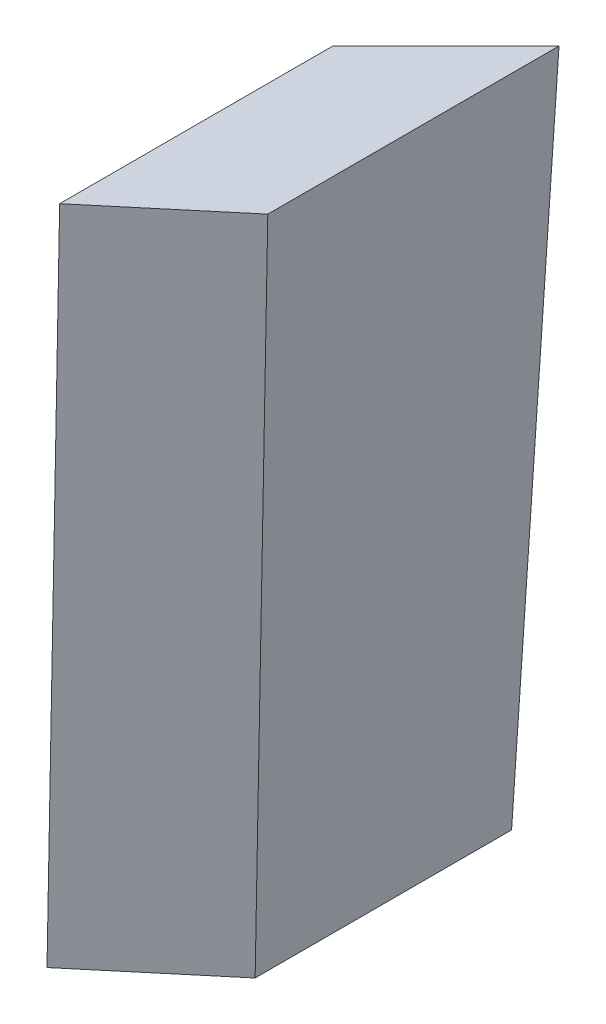
ISO-10303-21;
HEADER;
FILE_DESCRIPTION(('STEP AP214'),'2;1');
FILE_NAME('part.step','',(''),(''),'','','');
FILE_SCHEMA(('AUTOMOTIVE_DESIGN { 1 0 10303 214 1 1 1 1 }'));
ENDSEC;
DATA;
#1=APPLICATION_CONTEXT('core data for automotive mechanical design processes');
#2=APPLICATION_PROTOCOL_DEFINITION('international standard','automotive_design',2000,#1);
#3=PRODUCT_CONTEXT('',#1,'mechanical');
#4=PRODUCT('Part','Part','',(#3));
#5=PRODUCT_RELATED_PRODUCT_CATEGORY('part','',(#4));
#6=PRODUCT_DEFINITION_FORMATION('','',#4);
#7=PRODUCT_DEFINITION_CONTEXT('part definition',#1,'design');
#8=PRODUCT_DEFINITION('design','',#6,#7);
#9=PRODUCT_DEFINITION_SHAPE('','',#8);
#10=(LENGTH_UNIT() NAMED_UNIT(*) SI_UNIT(.MILLI.,.METRE.));
#11=(NAMED_UNIT(*) PLANE_ANGLE_UNIT() SI_UNIT($,.RADIAN.));
#12=(NAMED_UNIT(*) SI_UNIT($,.STERADIAN.) SOLID_ANGLE_UNIT());
#13=UNCERTAINTY_MEASURE_WITH_UNIT(LENGTH_MEASURE(1.E-05),#10,'distance_accuracy_value','');
#14=(GEOMETRIC_REPRESENTATION_CONTEXT(3) GLOBAL_UNCERTAINTY_ASSIGNED_CONTEXT((#13)) GLOBAL_UNIT_ASSIGNED_CONTEXT((#10,
#11,#12)) REPRESENTATION_CONTEXT('',''));
#15=CARTESIAN_POINT('',(0.,0.,0.));
#16=DIRECTION('',(0.,0.,1.));
#17=DIRECTION('',(1.,0.,0.));
#18=AXIS2_PLACEMENT_3D('',#15,#16,#17);
#19=CARTESIAN_POINT('',(0.,75.,0.));
#20=DIRECTION('',(0.,-1.,0.));
#21=DIRECTION('',(0.,0.,-1.));
#22=AXIS2_PLACEMENT_3D('',#19,#20,#21);
#23=PLANE('',#22);
#24=DIRECTION('',(0.,0.,-1.));
#25=VECTOR('',#24,1.);
#26=CARTESIAN_POINT('',(15.1158054915114,75.,-9.27748756218901));
#27=LINE('',#26,#25);
#28=CARTESIAN_POINT('',(15.1158054915114,75.,-9.27748756218901));
#29=VERTEX_POINT('',#28);
#30=CARTESIAN_POINT('',(15.1158054915114,75.,-41.447487562189));
#31=VERTEX_POINT('',#30);
#32=EDGE_CURVE('E107',#29,#31,#27,.T.);
#33=ORIENTED_EDGE('',*,*,#32,.T.);
#34=DIRECTION('',(-0.706776328705397,0.,0.707437079309334));
#35=VECTOR('',#34,1.);
#36=CARTESIAN_POINT('',(15.1158054915114,75.,-41.447487562189));
#37=LINE('',#36,#35);
#38=CARTESIAN_POINT('',(2.62,75.,-28.94));
#39=VERTEX_POINT('',#38);
#40=EDGE_CURVE('E103',#31,#39,#37,.T.);
#41=ORIENTED_EDGE('',*,*,#40,.T.);
#42=DIRECTION('',(0.,0.,1.));
#43=VECTOR('',#42,1.);
#44=CARTESIAN_POINT('',(2.62,75.,-28.94));
#45=LINE('',#44,#43);
#46=CARTESIAN_POINT('',(2.62,75.,1.22));
#47=VERTEX_POINT('',#46);
#48=EDGE_CURVE('E61',#39,#47,#45,.T.);
#49=ORIENTED_EDGE('',*,*,#48,.T.);
#50=DIRECTION('',(0.765674356097513,0.,-0.643228404545895));
#51=VECTOR('',#50,1.);
#52=CARTESIAN_POINT('',(2.62,75.,1.22));
#53=LINE('',#52,#51);
#54=EDGE_CURVE('E12',#47,#29,#53,.T.);
#55=ORIENTED_EDGE('',*,*,#54,.T.);
#56=EDGE_LOOP('',(#33,#41,#49,#55));
#57=FACE_BOUND('',#56,.T.);
#58=ADVANCED_FACE('F50',(#57),#23,.F.);
#59=CARTESIAN_POINT('',(0.,0.,0.));
#60=DIRECTION('',(0.,-1.,0.));
#61=DIRECTION('',(0.,0.,-1.));
#62=AXIS2_PLACEMENT_3D('',#59,#60,#61);
#63=PLANE('',#62);
#64=DIRECTION('',(0.76567435609751,0.,-0.6432284045459));
#65=VECTOR('',#64,1.);
#66=CARTESIAN_POINT('',(12.4958054915114,0.,-10.4974875621891));
#67=LINE('',#66,#65);
#68=CARTESIAN_POINT('',(0.,0.,0.));
#69=VERTEX_POINT('',#68);
#70=CARTESIAN_POINT('',(12.4958054915114,0.,-10.4974875621891));
#71=VERTEX_POINT('',#70);
#72=EDGE_CURVE('E167',#69,#71,#67,.T.);
#73=ORIENTED_EDGE('',*,*,#72,.F.);
#74=DIRECTION('',(0.,0.,1.));
#75=VECTOR('',#74,1.);
#76=CARTESIAN_POINT('',(0.,0.,0.));
#77=LINE('',#76,#75);
#78=CARTESIAN_POINT('',(0.,0.,-26.32));
#79=VERTEX_POINT('',#78);
#80=EDGE_CURVE('E125',#79,#69,#77,.T.);
#81=ORIENTED_EDGE('',*,*,#80,.F.);
#82=DIRECTION('',(-0.706776328705393,0.,0.707437079309338));
#83=VECTOR('',#82,1.);
#84=CARTESIAN_POINT('',(0.,0.,-26.32));
#85=LINE('',#84,#83);
#86=CARTESIAN_POINT('',(12.4958054915114,0.,-38.8274875621891));
#87=VERTEX_POINT('',#86);
#88=EDGE_CURVE('E99',#87,#79,#85,.T.);
#89=ORIENTED_EDGE('',*,*,#88,.F.);
#90=DIRECTION('',(0.,0.,-1.));
#91=VECTOR('',#90,1.);
#92=CARTESIAN_POINT('',(12.4958054915114,0.,-38.8274875621891));
#93=LINE('',#92,#91);
#94=EDGE_CURVE('E111',#71,#87,#93,.T.);
#95=ORIENTED_EDGE('',*,*,#94,.F.);
#96=EDGE_LOOP('',(#73,#81,#89,#95));
#97=FACE_BOUND('',#96,.T.);
#98=ADVANCED_FACE('F124',(#97),#63,.T.);
#99=CARTESIAN_POINT('',(0.,0.,0.));
#100=DIRECTION('',(0.999390389002902,-0.034912037589168,0.));
#101=DIRECTION('',(0.034912037589168,0.999390389002902,0.));
#102=AXIS2_PLACEMENT_3D('',#99,#100,#101);
#103=PLANE('',#102);
#104=DIRECTION('',(0.0349074251930192,0.999258354762,0.0162546025707952));
#105=VECTOR('',#104,1.);
#106=CARTESIAN_POINT('',(0.,0.,0.));
#107=LINE('',#106,#105);
#108=EDGE_CURVE('E76',#69,#47,#107,.T.);
#109=ORIENTED_EDGE('',*,*,#108,.T.);
#110=ORIENTED_EDGE('',*,*,#48,.F.);
#111=DIRECTION('',(0.0348907807439382,0.99878189152495,-0.0348907807439383));
#112=VECTOR('',#111,1.);
#113=CARTESIAN_POINT('',(0.,0.,-26.32));
#114=LINE('',#113,#112);
#115=EDGE_CURVE('E214',#79,#39,#114,.T.);
#116=ORIENTED_EDGE('',*,*,#115,.F.);
#117=ORIENTED_EDGE('',*,*,#80,.T.);
#118=EDGE_LOOP('',(#109,#110,#116,#117));
#119=FACE_BOUND('',#118,.T.);
#120=ADVANCED_FACE('F145',(#119),#103,.F.);
#121=CARTESIAN_POINT('',(-13.1599942474462,0.000429383623994045,-13.1477027314922));
#122=DIRECTION('',(0.707437079120876,-2.3082221091368E-05,0.706776328517116));
#123=DIRECTION('',(0.706776328705397,0.,-0.707437079309334));
#124=AXIS2_PLACEMENT_3D('',#121,#122,#123);
#125=PLANE('',#124);
#126=ORIENTED_EDGE('',*,*,#115,.T.);
#127=ORIENTED_EDGE('',*,*,#40,.F.);
#128=DIRECTION('',(0.034890780743939,0.99878189152495,-0.0348907807439373));
#129=VECTOR('',#128,1.);
#130=CARTESIAN_POINT('',(12.4958054915114,0.,-38.8274875621891));
#131=LINE('',#130,#129);
#132=EDGE_CURVE('E94',#87,#31,#131,.T.);
#133=ORIENTED_EDGE('',*,*,#132,.F.);
#134=ORIENTED_EDGE('',*,*,#88,.T.);
#135=EDGE_LOOP('',(#126,#127,#133,#134));
#136=FACE_BOUND('',#135,.T.);
#137=ADVANCED_FACE('F97',(#136),#125,.F.);
#138=CARTESIAN_POINT('',(0.,0.,0.));
#139=DIRECTION('',(-0.642836470489253,0.0349038011250968,-0.765207812869118));
#140=DIRECTION('',(-0.765674356097513,0.,0.643228404545895));
#141=AXIS2_PLACEMENT_3D('',#138,#139,#140);
#142=PLANE('',#141);
#143=DIRECTION('',(0.0349074251930199,0.999258354762,0.0162546025707962));
#144=VECTOR('',#143,1.);
#145=CARTESIAN_POINT('',(12.4958054915114,0.,-10.4974875621891));
#146=LINE('',#145,#144);
#147=EDGE_CURVE('E108',#71,#29,#146,.T.);
#148=ORIENTED_EDGE('',*,*,#147,.T.);
#149=ORIENTED_EDGE('',*,*,#54,.F.);
#150=ORIENTED_EDGE('',*,*,#108,.F.);
#151=ORIENTED_EDGE('',*,*,#72,.T.);
#152=EDGE_LOOP('',(#148,#149,#150,#151));
#153=FACE_BOUND('',#152,.T.);
#154=ADVANCED_FACE('F223',(#153),#142,.F.);
#155=CARTESIAN_POINT('',(12.4805749743817,-0.435988085771744,0.));
#156=DIRECTION('',(-0.999390389002902,0.0349120375891688,0.));
#157=DIRECTION('',(-0.0349120375891688,-0.999390389002902,0.));
#158=AXIS2_PLACEMENT_3D('',#155,#156,#157);
#159=PLANE('',#158);
#160=ORIENTED_EDGE('',*,*,#132,.T.);
#161=ORIENTED_EDGE('',*,*,#32,.F.);
#162=ORIENTED_EDGE('',*,*,#147,.F.);
#163=ORIENTED_EDGE('',*,*,#94,.T.);
#164=EDGE_LOOP('',(#160,#161,#162,#163));
#165=FACE_BOUND('',#164,.T.);
#166=ADVANCED_FACE('F113',(#165),#159,.F.);
#167=CLOSED_SHELL('',(#58,#98,#120,#137,#154,#166));
#168=MANIFOLD_SOLID_BREP('B2',#167);
#169=ADVANCED_BREP_SHAPE_REPRESENTATION('',(#18,#168),#14);
#170=SHAPE_DEFINITION_REPRESENTATION(#9,#169);
ENDSEC;
END-ISO-10303-21;
